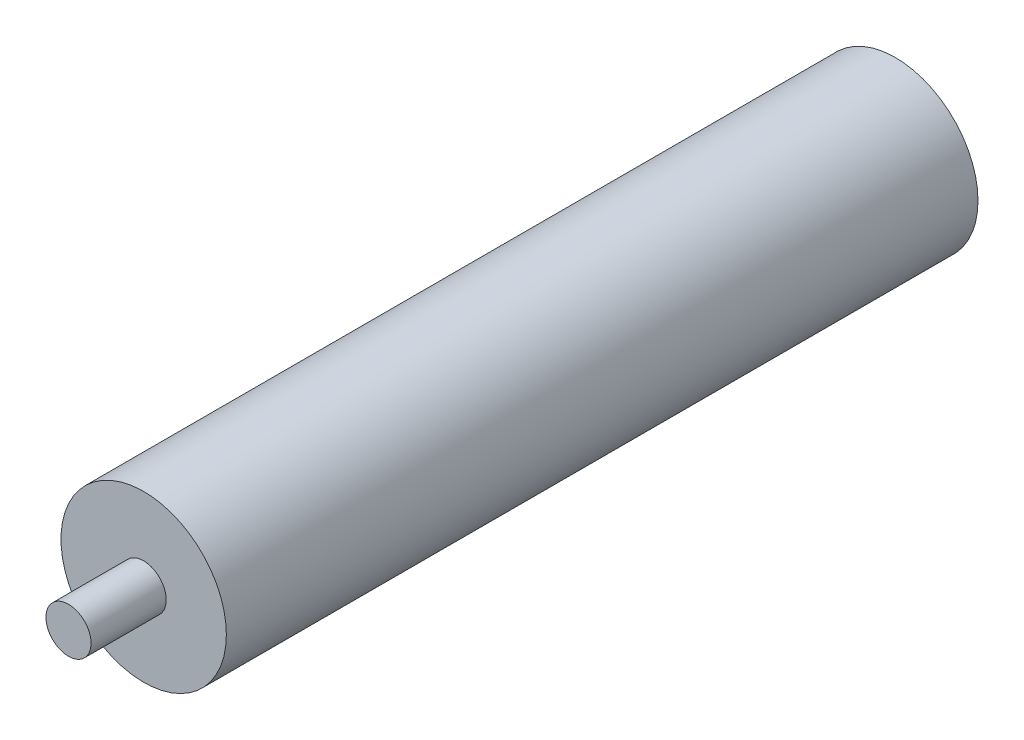
ISO-10303-21;
HEADER;
FILE_DESCRIPTION(('STEP AP214'),'2;1');
FILE_NAME('part.step','',(''),(''),'','','');
FILE_SCHEMA(('AUTOMOTIVE_DESIGN { 1 0 10303 214 1 1 1 1 }'));
ENDSEC;
DATA;
#1=APPLICATION_CONTEXT('core data for automotive mechanical design processes');
#2=APPLICATION_PROTOCOL_DEFINITION('international standard','automotive_design',2000,#1);
#3=PRODUCT_CONTEXT('',#1,'mechanical');
#4=PRODUCT('Part','Part','',(#3));
#5=PRODUCT_RELATED_PRODUCT_CATEGORY('part','',(#4));
#6=PRODUCT_DEFINITION_FORMATION('','',#4);
#7=PRODUCT_DEFINITION_CONTEXT('part definition',#1,'design');
#8=PRODUCT_DEFINITION('design','',#6,#7);
#9=PRODUCT_DEFINITION_SHAPE('','',#8);
#10=(LENGTH_UNIT() NAMED_UNIT(*) SI_UNIT(.MILLI.,.METRE.));
#11=(NAMED_UNIT(*) PLANE_ANGLE_UNIT() SI_UNIT($,.RADIAN.));
#12=(NAMED_UNIT(*) SI_UNIT($,.STERADIAN.) SOLID_ANGLE_UNIT());
#13=UNCERTAINTY_MEASURE_WITH_UNIT(LENGTH_MEASURE(1.E-05),#10,'distance_accuracy_value','');
#14=(GEOMETRIC_REPRESENTATION_CONTEXT(3) GLOBAL_UNCERTAINTY_ASSIGNED_CONTEXT((#13)) GLOBAL_UNIT_ASSIGNED_CONTEXT((#10,
#11,#12)) REPRESENTATION_CONTEXT('',''));
#15=CARTESIAN_POINT('',(0.,0.,0.));
#16=DIRECTION('',(0.,0.,1.));
#17=DIRECTION('',(1.,0.,0.));
#18=AXIS2_PLACEMENT_3D('',#15,#16,#17);
#19=CARTESIAN_POINT('',(0.,0.,50.));
#20=DIRECTION('',(0.,0.,1.));
#21=DIRECTION('',(1.,0.,0.));
#22=AXIS2_PLACEMENT_3D('',#19,#20,#21);
#23=PLANE('',#22);
#24=CARTESIAN_POINT('',(0.,0.,50.));
#25=DIRECTION('',(0.,0.,1.));
#26=DIRECTION('',(1.,0.,0.));
#27=AXIS2_PLACEMENT_3D('',#24,#25,#26);
#28=CIRCLE('',#27,5.5);
#29=CARTESIAN_POINT('',(5.5,0.,50.));
#30=VERTEX_POINT('',#29);
#31=EDGE_CURVE('E10',#30,#30,#28,.T.);
#32=ORIENTED_EDGE('',*,*,#31,.T.);
#33=EDGE_LOOP('',(#32));
#34=FACE_BOUND('',#33,.T.);
#35=CARTESIAN_POINT('',(0.,0.,50.));
#36=DIRECTION('',(0.,0.,1.));
#37=DIRECTION('',(1.,0.,0.));
#38=AXIS2_PLACEMENT_3D('',#35,#36,#37);
#39=CIRCLE('',#38,1.5);
#40=CARTESIAN_POINT('',(1.5,0.,50.));
#41=VERTEX_POINT('',#40);
#42=EDGE_CURVE('E43',#41,#41,#39,.T.);
#43=ORIENTED_EDGE('',*,*,#42,.F.);
#44=EDGE_LOOP('',(#43));
#45=FACE_BOUND('',#44,.T.);
#46=ADVANCED_FACE('F30',(#34,#45),#23,.T.);
#47=CARTESIAN_POINT('',(0.,0.,50.));
#48=DIRECTION('',(0.,0.,-1.));
#49=DIRECTION('',(-1.,0.,0.));
#50=AXIS2_PLACEMENT_3D('',#47,#48,#49);
#51=CYLINDRICAL_SURFACE('',#50,5.5);
#52=ORIENTED_EDGE('',*,*,#31,.F.);
#53=EDGE_LOOP('',(#52));
#54=FACE_BOUND('',#53,.T.);
#55=CARTESIAN_POINT('',(0.,0.,0.));
#56=DIRECTION('',(0.,0.,1.));
#57=DIRECTION('',(1.,0.,0.));
#58=AXIS2_PLACEMENT_3D('',#55,#56,#57);
#59=CIRCLE('',#58,5.5);
#60=CARTESIAN_POINT('',(5.5,0.,0.));
#61=VERTEX_POINT('',#60);
#62=EDGE_CURVE('E34',#61,#61,#59,.T.);
#63=ORIENTED_EDGE('',*,*,#62,.T.);
#64=EDGE_LOOP('',(#63));
#65=FACE_BOUND('',#64,.T.);
#66=ADVANCED_FACE('F32',(#54,#65),#51,.T.);
#67=CARTESIAN_POINT('',(0.,0.,0.));
#68=DIRECTION('',(0.,0.,1.));
#69=DIRECTION('',(1.,0.,0.));
#70=AXIS2_PLACEMENT_3D('',#67,#68,#69);
#71=PLANE('',#70);
#72=ORIENTED_EDGE('',*,*,#62,.F.);
#73=EDGE_LOOP('',(#72));
#74=FACE_BOUND('',#73,.T.);
#75=ADVANCED_FACE('F54',(#74),#71,.F.);
#76=CARTESIAN_POINT('',(0.,0.,55.));
#77=DIRECTION('',(0.,0.,-1.));
#78=DIRECTION('',(-1.,0.,0.));
#79=AXIS2_PLACEMENT_3D('',#76,#77,#78);
#80=CYLINDRICAL_SURFACE('',#79,1.5);
#81=CARTESIAN_POINT('',(0.,0.,55.));
#82=DIRECTION('',(0.,0.,1.));
#83=DIRECTION('',(1.,0.,0.));
#84=AXIS2_PLACEMENT_3D('',#81,#82,#83);
#85=CIRCLE('',#84,1.5);
#86=CARTESIAN_POINT('',(1.5,0.,55.));
#87=VERTEX_POINT('',#86);
#88=EDGE_CURVE('E41',#87,#87,#85,.T.);
#89=ORIENTED_EDGE('',*,*,#88,.F.);
#90=EDGE_LOOP('',(#89));
#91=FACE_BOUND('',#90,.T.);
#92=ORIENTED_EDGE('',*,*,#42,.T.);
#93=EDGE_LOOP('',(#92));
#94=FACE_BOUND('',#93,.T.);
#95=ADVANCED_FACE('F51',(#91,#94),#80,.T.);
#96=CARTESIAN_POINT('',(0.,0.,55.));
#97=DIRECTION('',(0.,0.,1.));
#98=DIRECTION('',(1.,0.,0.));
#99=AXIS2_PLACEMENT_3D('',#96,#97,#98);
#100=PLANE('',#99);
#101=ORIENTED_EDGE('',*,*,#88,.T.);
#102=EDGE_LOOP('',(#101));
#103=FACE_BOUND('',#102,.T.);
#104=ADVANCED_FACE('F49',(#103),#100,.T.);
#105=CLOSED_SHELL('',(#46,#66,#75,#95,#104));
#106=MANIFOLD_SOLID_BREP('B2',#105);
#107=ADVANCED_BREP_SHAPE_REPRESENTATION('',(#18,#106),#14);
#108=SHAPE_DEFINITION_REPRESENTATION(#9,#107);
ENDSEC;
END-ISO-10303-21;
